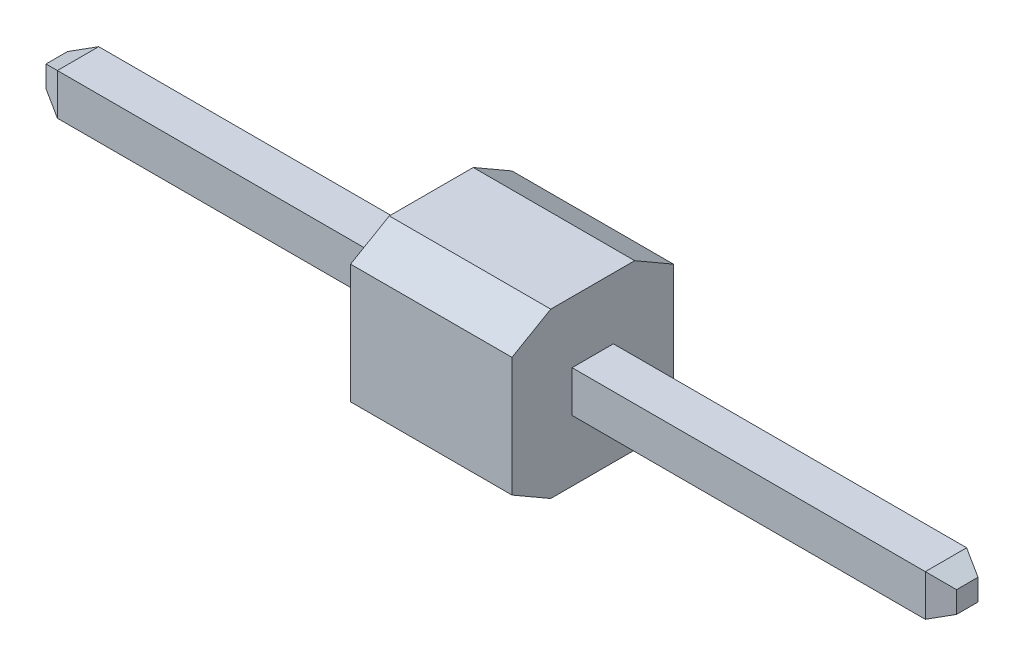
ISO-10303-21;
HEADER;
FILE_DESCRIPTION(('STEP AP214'),'2;1');
FILE_NAME('part.step','',(''),(''),'','','');
FILE_SCHEMA(('AUTOMOTIVE_DESIGN { 1 0 10303 214 1 1 1 1 }'));
ENDSEC;
DATA;
#1=APPLICATION_CONTEXT('core data for automotive mechanical design processes');
#2=APPLICATION_PROTOCOL_DEFINITION('international standard','automotive_design',2000,#1);
#3=PRODUCT_CONTEXT('',#1,'mechanical');
#4=PRODUCT('Part','Part','',(#3));
#5=PRODUCT_RELATED_PRODUCT_CATEGORY('part','',(#4));
#6=PRODUCT_DEFINITION_FORMATION('','',#4);
#7=PRODUCT_DEFINITION_CONTEXT('part definition',#1,'design');
#8=PRODUCT_DEFINITION('design','',#6,#7);
#9=PRODUCT_DEFINITION_SHAPE('','',#8);
#10=(LENGTH_UNIT() NAMED_UNIT(*) SI_UNIT(.MILLI.,.METRE.));
#11=(NAMED_UNIT(*) PLANE_ANGLE_UNIT() SI_UNIT($,.RADIAN.));
#12=(NAMED_UNIT(*) SI_UNIT($,.STERADIAN.) SOLID_ANGLE_UNIT());
#13=UNCERTAINTY_MEASURE_WITH_UNIT(LENGTH_MEASURE(1.E-05),#10,'distance_accuracy_value','');
#14=(GEOMETRIC_REPRESENTATION_CONTEXT(3) GLOBAL_UNCERTAINTY_ASSIGNED_CONTEXT((#13)) GLOBAL_UNIT_ASSIGNED_CONTEXT((#10,
#11,#12)) REPRESENTATION_CONTEXT('',''));
#15=CARTESIAN_POINT('',(0.,0.,0.));
#16=DIRECTION('',(0.,0.,1.));
#17=DIRECTION('',(1.,0.,0.));
#18=AXIS2_PLACEMENT_3D('',#15,#16,#17);
#19=CARTESIAN_POINT('',(5.42107439041138,12.3828717370861,0.629998634255617));
#20=DIRECTION('',(1.,4.37113882867379E-08,-4.37113882867379E-08));
#21=DIRECTION('',(-4.37113882867379E-08,1.,0.));
#22=AXIS2_PLACEMENT_3D('',#19,#20,#21);
#23=PLANE('',#22);
#24=DIRECTION('',(1.59994790123753E-08,0.50000000000019,0.866025403784329));
#25=VECTOR('',#24,1.);
#26=CARTESIAN_POINT('',(5.42107426742546,13.6264615755721,-0.940001365744382));
#27=LINE('',#26,#25);
#28=CARTESIAN_POINT('',(5.42107426742546,13.6264615755721,-0.940001365744382));
#29=VERTEX_POINT('',#28);
#30=CARTESIAN_POINT('',(5.42107427851022,13.9728717370861,-0.340001365744383));
#31=VERTEX_POINT('',#30);
#32=EDGE_CURVE('E11',#29,#31,#27,.T.);
#33=ORIENTED_EDGE('',*,*,#32,.T.);
#34=DIRECTION('',(4.37113886966664E-08,0.,0.999999999999999));
#35=VECTOR('',#34,1.);
#36=CARTESIAN_POINT('',(5.42107427851022,13.9728717370861,-0.340001365744383));
#37=LINE('',#36,#35);
#38=CARTESIAN_POINT('',(5.42107433533503,13.9728717370861,0.959998634255618));
#39=VERTEX_POINT('',#38);
#40=EDGE_CURVE('E304',#31,#39,#37,.T.);
#41=ORIENTED_EDGE('',*,*,#40,.T.);
#42=DIRECTION('',(5.97108656004285E-08,-0.500000000000188,0.866025403784328));
#43=VECTOR('',#42,1.);
#44=CARTESIAN_POINT('',(5.42107433533503,13.9728717370861,0.959998634255618));
#45=LINE('',#44,#43);
#46=CARTESIAN_POINT('',(5.42107437670393,13.6264615755721,1.55999863425562));
#47=VERTEX_POINT('',#46);
#48=EDGE_CURVE('E296',#39,#47,#45,.T.);
#49=ORIENTED_EDGE('',*,*,#48,.T.);
#50=DIRECTION('',(4.37113884815071E-08,-0.999999999999999,0.));
#51=VECTOR('',#50,1.);
#52=CARTESIAN_POINT('',(5.42107437670393,13.6264615755721,1.55999863425562));
#53=LINE('',#52,#51);
#54=CARTESIAN_POINT('',(5.42107445744672,11.7792818986001,1.55999863425562));
#55=VERTEX_POINT('',#54);
#56=EDGE_CURVE('E281',#47,#55,#53,.T.);
#57=ORIENTED_EDGE('',*,*,#56,.T.);
#58=DIRECTION('',(1.59994777304001E-08,0.50000000000019,0.866025403784329));
#59=VECTOR('',#58,1.);
#60=CARTESIAN_POINT('',(5.42107444636195,11.4328717370861,0.959998634255618));
#61=LINE('',#60,#59);
#62=CARTESIAN_POINT('',(5.42107444636195,11.4328717370861,0.959998634255618));
#63=VERTEX_POINT('',#62);
#64=EDGE_CURVE('E265',#63,#55,#61,.T.);
#65=ORIENTED_EDGE('',*,*,#64,.F.);
#66=DIRECTION('',(4.37113886966664E-08,0.,0.999999999999999));
#67=VECTOR('',#66,1.);
#68=CARTESIAN_POINT('',(5.42107438953715,11.4328717370861,-0.340001365744383));
#69=LINE('',#68,#67);
#70=CARTESIAN_POINT('',(5.42107438953715,11.4328717370861,-0.340001365744383));
#71=VERTEX_POINT('',#70);
#72=EDGE_CURVE('E248',#71,#63,#69,.T.);
#73=ORIENTED_EDGE('',*,*,#72,.F.);
#74=DIRECTION('',(5.97108668824036E-08,-0.500000000000188,0.866025403784328));
#75=VECTOR('',#74,1.);
#76=CARTESIAN_POINT('',(5.42107434816825,11.7792818986001,-0.940001365744382));
#77=LINE('',#76,#75);
#78=CARTESIAN_POINT('',(5.42107434816825,11.7792818986001,-0.940001365744382));
#79=VERTEX_POINT('',#78);
#80=EDGE_CURVE('E242',#79,#71,#77,.T.);
#81=ORIENTED_EDGE('',*,*,#80,.F.);
#82=DIRECTION('',(4.37113884815071E-08,-0.999999999999999,0.));
#83=VECTOR('',#82,1.);
#84=CARTESIAN_POINT('',(5.42107426742546,13.6264615755721,-0.940001365744382));
#85=LINE('',#84,#83);
#86=EDGE_CURVE('E236',#29,#79,#85,.T.);
#87=ORIENTED_EDGE('',*,*,#86,.F.);
#88=EDGE_LOOP('',(#33,#41,#49,#57,#65,#73,#81,#87));
#89=FACE_BOUND('',#88,.T.);
#90=DIRECTION('',(-4.37113900630947E-08,0.,-0.999999999999999));
#91=VECTOR('',#90,1.);
#92=CARTESIAN_POINT('',(5.42107436243609,13.0228717370861,0.629998634255617));
#93=LINE('',#92,#91);
#94=CARTESIAN_POINT('',(5.42107436243609,13.0228717370861,0.629998634255617));
#95=VERTEX_POINT('',#94);
#96=CARTESIAN_POINT('',(5.4210743344608,13.0228717370861,-0.0100013657443826));
#97=VERTEX_POINT('',#96);
#98=EDGE_CURVE('E302',#95,#97,#93,.T.);
#99=ORIENTED_EDGE('',*,*,#98,.T.);
#100=DIRECTION('',(-4.37113900630947E-08,0.999999999999999,0.));
#101=VECTOR('',#100,1.);
#102=CARTESIAN_POINT('',(5.42107436243609,12.3828717370861,-0.0100013657443826));
#103=LINE('',#102,#101);
#104=CARTESIAN_POINT('',(5.42107436243609,12.3828717370861,-0.0100013657443826));
#105=VERTEX_POINT('',#104);
#106=EDGE_CURVE('E293',#105,#97,#103,.T.);
#107=ORIENTED_EDGE('',*,*,#106,.F.);
#108=DIRECTION('',(-4.37113872875372E-08,0.,-0.999999999999999));
#109=VECTOR('',#108,1.);
#110=CARTESIAN_POINT('',(5.42107439041138,12.3828717370861,0.629998634255617));
#111=LINE('',#110,#109);
#112=CARTESIAN_POINT('',(5.42107439041138,12.3828717370861,0.629998634255617));
#113=VERTEX_POINT('',#112);
#114=EDGE_CURVE('E278',#113,#105,#111,.T.);
#115=ORIENTED_EDGE('',*,*,#114,.F.);
#116=DIRECTION('',(-4.37113872875371E-08,0.999999999999999,0.));
#117=VECTOR('',#116,1.);
#118=CARTESIAN_POINT('',(5.42107439041138,12.3828717370861,0.629998634255617));
#119=LINE('',#118,#117);
#120=EDGE_CURVE('E263',#113,#95,#119,.T.);
#121=ORIENTED_EDGE('',*,*,#120,.T.);
#122=EDGE_LOOP('',(#99,#107,#115,#121));
#123=FACE_BOUND('',#122,.T.);
#124=ADVANCED_FACE('F17',(#89,#123),#23,.T.);
#125=CARTESIAN_POINT('',(2.92107439041138,12.3828716278076,0.629998743534088));
#126=DIRECTION('',(1.,4.37113882867379E-08,-4.37113882867379E-08));
#127=DIRECTION('',(-4.37113882867379E-08,1.,0.));
#128=AXIS2_PLACEMENT_3D('',#125,#126,#127);
#129=PLANE('',#128);
#130=DIRECTION('',(1.59994783713877E-08,0.50000000000019,0.866025403784329));
#131=VECTOR('',#130,1.);
#132=CARTESIAN_POINT('',(2.92107426742546,13.6264614662936,-0.940001256465912));
#133=LINE('',#132,#131);
#134=CARTESIAN_POINT('',(2.92107426742546,13.6264614662936,-0.940001256465912));
#135=VERTEX_POINT('',#134);
#136=CARTESIAN_POINT('',(2.92107427851022,13.9728716278076,-0.340001256465912));
#137=VERTEX_POINT('',#136);
#138=EDGE_CURVE('E24',#135,#137,#133,.T.);
#139=ORIENTED_EDGE('',*,*,#138,.F.);
#140=DIRECTION('',(4.37113882410924E-08,-0.999999999999999,0.));
#141=VECTOR('',#140,1.);
#142=CARTESIAN_POINT('',(2.92107426742546,13.6264614662936,-0.940001256465912));
#143=LINE('',#142,#141);
#144=CARTESIAN_POINT('',(2.92107434816825,11.7792817893216,-0.940001256465912));
#145=VERTEX_POINT('',#144);
#146=EDGE_CURVE('E300',#135,#145,#143,.T.);
#147=ORIENTED_EDGE('',*,*,#146,.T.);
#148=DIRECTION('',(5.97108668824036E-08,-0.500000000000188,0.866025403784328));
#149=VECTOR('',#148,1.);
#150=CARTESIAN_POINT('',(2.92107434816825,11.7792817893216,-0.940001256465912));
#151=LINE('',#150,#149);
#152=CARTESIAN_POINT('',(2.92107438953715,11.4328716278076,-0.340001256465912));
#153=VERTEX_POINT('',#152);
#154=EDGE_CURVE('E286',#145,#153,#151,.T.);
#155=ORIENTED_EDGE('',*,*,#154,.T.);
#156=DIRECTION('',(4.37113883550593E-08,0.,0.999999999999999));
#157=VECTOR('',#156,1.);
#158=CARTESIAN_POINT('',(2.92107438953715,11.4328716278076,-0.340001256465912));
#159=LINE('',#158,#157);
#160=CARTESIAN_POINT('',(2.92107444636195,11.4328716278076,0.959998743534088));
#161=VERTEX_POINT('',#160);
#162=EDGE_CURVE('E271',#153,#161,#159,.T.);
#163=ORIENTED_EDGE('',*,*,#162,.T.);
#164=DIRECTION('',(1.59994783713877E-08,0.50000000000019,0.866025403784329));
#165=VECTOR('',#164,1.);
#166=CARTESIAN_POINT('',(2.92107444636195,11.4328716278076,0.959998743534088));
#167=LINE('',#166,#165);
#168=CARTESIAN_POINT('',(2.92107445744672,11.7792817893216,1.55999874353409));
#169=VERTEX_POINT('',#168);
#170=EDGE_CURVE('E253',#161,#169,#167,.T.);
#171=ORIENTED_EDGE('',*,*,#170,.T.);
#172=DIRECTION('',(4.37113882410924E-08,-0.999999999999999,0.));
#173=VECTOR('',#172,1.);
#174=CARTESIAN_POINT('',(2.92107437670393,13.6264614662936,1.55999874353409));
#175=LINE('',#174,#173);
#176=CARTESIAN_POINT('',(2.92107437670393,13.6264614662936,1.55999874353409));
#177=VERTEX_POINT('',#176);
#178=EDGE_CURVE('E261',#177,#169,#175,.T.);
#179=ORIENTED_EDGE('',*,*,#178,.F.);
#180=DIRECTION('',(5.97108668824036E-08,-0.500000000000188,0.866025403784328));
#181=VECTOR('',#180,1.);
#182=CARTESIAN_POINT('',(2.92107433533503,13.9728716278076,0.959998743534088));
#183=LINE('',#182,#181);
#184=CARTESIAN_POINT('',(2.92107433533503,13.9728716278076,0.959998743534088));
#185=VERTEX_POINT('',#184);
#186=EDGE_CURVE('E276',#185,#177,#183,.T.);
#187=ORIENTED_EDGE('',*,*,#186,.F.);
#188=DIRECTION('',(4.37113883550593E-08,0.,0.999999999999999));
#189=VECTOR('',#188,1.);
#190=CARTESIAN_POINT('',(2.92107427851022,13.9728716278076,-0.340001256465912));
#191=LINE('',#190,#189);
#192=EDGE_CURVE('E291',#137,#185,#191,.T.);
#193=ORIENTED_EDGE('',*,*,#192,.F.);
#194=EDGE_LOOP('',(#139,#147,#155,#163,#171,#179,#187,#193));
#195=FACE_BOUND('',#194,.T.);
#196=DIRECTION('',(-4.37113886753159E-08,0.999999999999999,0.));
#197=VECTOR('',#196,1.);
#198=CARTESIAN_POINT('',(2.92107436243609,12.3828716278076,-0.0100012564659119));
#199=LINE('',#198,#197);
#200=CARTESIAN_POINT('',(2.92107436243609,12.3828716278076,-0.0100012564659119));
#201=VERTEX_POINT('',#200);
#202=CARTESIAN_POINT('',(2.9210743344608,13.0228716278076,-0.0100012564659119));
#203=VERTEX_POINT('',#202);
#204=EDGE_CURVE('E298',#201,#203,#199,.T.);
#205=ORIENTED_EDGE('',*,*,#204,.T.);
#206=DIRECTION('',(-4.37113886753159E-08,0.,-0.999999999999999));
#207=VECTOR('',#206,1.);
#208=CARTESIAN_POINT('',(2.92107436243609,13.0228716278076,0.629998743534088));
#209=LINE('',#208,#207);
#210=CARTESIAN_POINT('',(2.92107436243609,13.0228716278076,0.629998743534088));
#211=VERTEX_POINT('',#210);
#212=EDGE_CURVE('E283',#211,#203,#209,.T.);
#213=ORIENTED_EDGE('',*,*,#212,.F.);
#214=DIRECTION('',(-4.37113879814265E-08,0.999999999999999,0.));
#215=VECTOR('',#214,1.);
#216=CARTESIAN_POINT('',(2.92107439041138,12.3828716278076,0.629998743534088));
#217=LINE('',#216,#215);
#218=CARTESIAN_POINT('',(2.92107439041138,12.3828716278076,0.629998743534088));
#219=VERTEX_POINT('',#218);
#220=EDGE_CURVE('E268',#219,#211,#217,.T.);
#221=ORIENTED_EDGE('',*,*,#220,.F.);
#222=DIRECTION('',(-4.37113879814266E-08,0.,-0.999999999999999));
#223=VECTOR('',#222,1.);
#224=CARTESIAN_POINT('',(2.92107439041138,12.3828716278076,0.629998743534088));
#225=LINE('',#224,#223);
#226=EDGE_CURVE('E251',#219,#201,#225,.T.);
#227=ORIENTED_EDGE('',*,*,#226,.T.);
#228=EDGE_LOOP('',(#205,#213,#221,#227));
#229=FACE_BOUND('',#228,.T.);
#230=ADVANCED_FACE('F314',(#195,#229),#129,.F.);
#231=CARTESIAN_POINT('',(5.42107426742546,13.6264615755721,-0.940001365744382));
#232=DIRECTION('',(5.97108668343731E-08,-0.866025403784328,0.50000000000019));
#233=DIRECTION('',(-1.59994785476185E-08,-0.500000000000192,-0.866025403784329));
#234=AXIS2_PLACEMENT_3D('',#231,#232,#233);
#235=PLANE('',#234);
#236=ORIENTED_EDGE('',*,*,#138,.T.);
#237=DIRECTION('',(-0.999999999999998,-4.37113882867378E-08,4.37113883755557E-08));
#238=VECTOR('',#237,1.);
#239=CARTESIAN_POINT('',(5.42107427851022,13.9728717370861,-0.340001365744383));
#240=LINE('',#239,#238);
#241=EDGE_CURVE('E288',#31,#137,#240,.T.);
#242=ORIENTED_EDGE('',*,*,#241,.F.);
#243=ORIENTED_EDGE('',*,*,#32,.F.);
#244=DIRECTION('',(-0.999999999999998,-4.37113882867378E-08,4.37113881091022E-08));
#245=VECTOR('',#244,1.);
#246=CARTESIAN_POINT('',(5.42107426742546,13.6264615755721,-0.940001365744382));
#247=LINE('',#246,#245);
#248=EDGE_CURVE('E256',#29,#135,#247,.T.);
#249=ORIENTED_EDGE('',*,*,#248,.T.);
#250=EDGE_LOOP('',(#236,#242,#243,#249));
#251=FACE_BOUND('',#250,.T.);
#252=ADVANCED_FACE('F306',(#251),#235,.F.);
#253=CARTESIAN_POINT('',(5.42107427851022,13.9728717370861,-0.340001365744383));
#254=DIRECTION('',(4.37113882867379E-08,-1.,0.));
#255=DIRECTION('',(1.,4.37113882867379E-08,-4.37113882867379E-08));
#256=AXIS2_PLACEMENT_3D('',#253,#254,#255);
#257=PLANE('',#256);
#258=ORIENTED_EDGE('',*,*,#192,.T.);
#259=DIRECTION('',(-0.999999999999998,-4.37113882867378E-08,4.37113882867378E-08));
#260=VECTOR('',#259,1.);
#261=CARTESIAN_POINT('',(5.42107433533503,13.9728717370861,0.959998634255618));
#262=LINE('',#261,#260);
#263=EDGE_CURVE('E273',#39,#185,#262,.T.);
#264=ORIENTED_EDGE('',*,*,#263,.F.);
#265=ORIENTED_EDGE('',*,*,#40,.F.);
#266=ORIENTED_EDGE('',*,*,#241,.T.);
#267=EDGE_LOOP('',(#258,#264,#265,#266));
#268=FACE_BOUND('',#267,.T.);
#269=ADVANCED_FACE('F311',(#268),#257,.F.);
#270=CARTESIAN_POINT('',(5.42107433533503,13.9728717370861,0.959998634255618));
#271=DIRECTION('',(1.59994785476185E-08,-0.86602540378433,-0.50000000000019));
#272=DIRECTION('',(-5.97108668343731E-08,0.500000000000188,-0.866025403784329));
#273=AXIS2_PLACEMENT_3D('',#270,#271,#272);
#274=PLANE('',#273);
#275=ORIENTED_EDGE('',*,*,#186,.T.);
#276=DIRECTION('',(-0.999999999999998,-4.37113882867378E-08,4.37113882867378E-08));
#277=VECTOR('',#276,1.);
#278=CARTESIAN_POINT('',(5.42107437670393,13.6264615755721,1.55999863425562));
#279=LINE('',#278,#277);
#280=EDGE_CURVE('E258',#47,#177,#279,.T.);
#281=ORIENTED_EDGE('',*,*,#280,.F.);
#282=ORIENTED_EDGE('',*,*,#48,.F.);
#283=ORIENTED_EDGE('',*,*,#263,.T.);
#284=EDGE_LOOP('',(#275,#281,#282,#283));
#285=FACE_BOUND('',#284,.T.);
#286=ADVANCED_FACE('F319',(#285),#274,.F.);
#287=CARTESIAN_POINT('',(5.42107437670393,13.6264615755721,1.55999863425562));
#288=DIRECTION('',(-4.37113882867379E-08,0.,-1.));
#289=DIRECTION('',(-1.,-4.37113882867379E-08,4.37113882867379E-08));
#290=AXIS2_PLACEMENT_3D('',#287,#288,#289);
#291=PLANE('',#290);
#292=ORIENTED_EDGE('',*,*,#178,.T.);
#293=DIRECTION('',(-0.999999999999998,-4.37113882867378E-08,4.37113882867378E-08));
#294=VECTOR('',#293,1.);
#295=CARTESIAN_POINT('',(5.42107445744672,11.7792818986001,1.55999863425562));
#296=LINE('',#295,#294);
#297=EDGE_CURVE('E245',#55,#169,#296,.T.);
#298=ORIENTED_EDGE('',*,*,#297,.F.);
#299=ORIENTED_EDGE('',*,*,#56,.F.);
#300=ORIENTED_EDGE('',*,*,#280,.T.);
#301=EDGE_LOOP('',(#292,#298,#299,#300));
#302=FACE_BOUND('',#301,.T.);
#303=ADVANCED_FACE('F326',(#302),#291,.F.);
#304=CARTESIAN_POINT('',(5.42107444636195,11.4328717370861,0.959998634255618));
#305=DIRECTION('',(5.97108668343731E-08,-0.866025403784328,0.50000000000019));
#306=DIRECTION('',(-1.59994785476185E-08,-0.500000000000192,-0.866025403784329));
#307=AXIS2_PLACEMENT_3D('',#304,#305,#306);
#308=PLANE('',#307);
#309=ORIENTED_EDGE('',*,*,#170,.F.);
#310=DIRECTION('',(-0.999999999999998,-4.37113882867378E-08,4.37113882867378E-08));
#311=VECTOR('',#310,1.);
#312=CARTESIAN_POINT('',(5.42107444636195,11.4328717370861,0.959998634255618));
#313=LINE('',#312,#311);
#314=EDGE_CURVE('E239',#63,#161,#313,.T.);
#315=ORIENTED_EDGE('',*,*,#314,.F.);
#316=ORIENTED_EDGE('',*,*,#64,.T.);
#317=ORIENTED_EDGE('',*,*,#297,.T.);
#318=EDGE_LOOP('',(#309,#315,#316,#317));
#319=FACE_BOUND('',#318,.T.);
#320=ADVANCED_FACE('F329',(#319),#308,.T.);
#321=CARTESIAN_POINT('',(5.42107438953715,11.4328717370861,-0.340001365744383));
#322=DIRECTION('',(4.37113882867379E-08,-1.,0.));
#323=DIRECTION('',(1.,4.37113882867379E-08,-4.37113882867379E-08));
#324=AXIS2_PLACEMENT_3D('',#321,#322,#323);
#325=PLANE('',#324);
#326=ORIENTED_EDGE('',*,*,#162,.F.);
#327=DIRECTION('',(-0.999999999999998,-4.37113889972806E-08,4.37113883755557E-08));
#328=VECTOR('',#327,1.);
#329=CARTESIAN_POINT('',(5.42107438953715,11.4328717370861,-0.340001365744383));
#330=LINE('',#329,#328);
#331=EDGE_CURVE('E233',#71,#153,#330,.T.);
#332=ORIENTED_EDGE('',*,*,#331,.F.);
#333=ORIENTED_EDGE('',*,*,#72,.T.);
#334=ORIENTED_EDGE('',*,*,#314,.T.);
#335=EDGE_LOOP('',(#326,#332,#333,#334));
#336=FACE_BOUND('',#335,.T.);
#337=ADVANCED_FACE('F333',(#336),#325,.T.);
#338=CARTESIAN_POINT('',(5.42107434816825,11.7792818986001,-0.940001365744382));
#339=DIRECTION('',(1.59994785476185E-08,-0.86602540378433,-0.50000000000019));
#340=DIRECTION('',(-5.97108668343731E-08,0.500000000000188,-0.866025403784329));
#341=AXIS2_PLACEMENT_3D('',#338,#339,#340);
#342=PLANE('',#341);
#343=ORIENTED_EDGE('',*,*,#154,.F.);
#344=DIRECTION('',(-0.999999999999998,-4.37113882867378E-08,4.37113881091022E-08));
#345=VECTOR('',#344,1.);
#346=CARTESIAN_POINT('',(5.42107434816825,11.7792818986001,-0.940001365744382));
#347=LINE('',#346,#345);
#348=EDGE_CURVE('E230',#79,#145,#347,.T.);
#349=ORIENTED_EDGE('',*,*,#348,.F.);
#350=ORIENTED_EDGE('',*,*,#80,.T.);
#351=ORIENTED_EDGE('',*,*,#331,.T.);
#352=EDGE_LOOP('',(#343,#349,#350,#351));
#353=FACE_BOUND('',#352,.T.);
#354=ADVANCED_FACE('F337',(#353),#342,.T.);
#355=CARTESIAN_POINT('',(5.42107426742546,13.6264615755721,-0.940001365744382));
#356=DIRECTION('',(-4.37113882867379E-08,0.,-1.));
#357=DIRECTION('',(-4.37113882867379E-08,1.,0.));
#358=AXIS2_PLACEMENT_3D('',#355,#356,#357);
#359=PLANE('',#358);
#360=ORIENTED_EDGE('',*,*,#146,.F.);
#361=ORIENTED_EDGE('',*,*,#248,.F.);
#362=ORIENTED_EDGE('',*,*,#86,.T.);
#363=ORIENTED_EDGE('',*,*,#348,.T.);
#364=EDGE_LOOP('',(#360,#361,#362,#363));
#365=FACE_BOUND('',#364,.T.);
#366=ADVANCED_FACE('F339',(#365),#359,.T.);
#367=CARTESIAN_POINT('',(-2.87892560958862,12.3828713742816,0.62999899706014));
#368=DIRECTION('',(-1.,-4.37113882867379E-08,4.37113882867379E-08));
#369=DIRECTION('',(4.37113882867379E-08,-1.,0.));
#370=AXIS2_PLACEMENT_3D('',#367,#368,#369);
#371=PLANE('',#370);
#372=DIRECTION('',(4.37113927480282E-08,-0.999999999999999,0.));
#373=VECTOR('',#372,1.);
#374=CARTESIAN_POINT('',(-2.87892565208645,12.8689898470906,0.14388052425114));
#375=LINE('',#374,#373);
#376=CARTESIAN_POINT('',(-2.87892565208645,12.8689898470906,0.14388052425114));
#377=VERTEX_POINT('',#376);
#378=CARTESIAN_POINT('',(-2.87892563756391,12.5367529014726,0.14388052425114));
#379=VERTEX_POINT('',#378);
#380=EDGE_CURVE('E228',#377,#379,#375,.T.);
#381=ORIENTED_EDGE('',*,*,#380,.T.);
#382=DIRECTION('',(4.37113900746999E-08,0.,0.999999999999999));
#383=VECTOR('',#382,1.);
#384=CARTESIAN_POINT('',(-2.87892563756391,12.5367529014726,0.14388052425114));
#385=LINE('',#384,#383);
#386=CARTESIAN_POINT('',(-2.87892562304137,12.5367529014726,0.47611746986914));
#387=VERTEX_POINT('',#386);
#388=EDGE_CURVE('E223',#379,#387,#385,.T.);
#389=ORIENTED_EDGE('',*,*,#388,.T.);
#390=DIRECTION('',(-4.37113847280434E-08,0.999999999999999,0.));
#391=VECTOR('',#390,1.);
#392=CARTESIAN_POINT('',(-2.87892562304137,12.5367529014726,0.47611746986914));
#393=LINE('',#392,#391);
#394=CARTESIAN_POINT('',(-2.87892563756391,12.8689898470906,0.47611746986914));
#395=VERTEX_POINT('',#394);
#396=EDGE_CURVE('E215',#387,#395,#393,.T.);
#397=ORIENTED_EDGE('',*,*,#396,.T.);
#398=DIRECTION('',(-4.37113820547151E-08,0.,-0.999999999999999));
#399=VECTOR('',#398,1.);
#400=CARTESIAN_POINT('',(-2.87892563756391,12.8689898470906,0.47611746986914));
#401=LINE('',#400,#399);
#402=EDGE_CURVE('E207',#395,#377,#401,.T.);
#403=ORIENTED_EDGE('',*,*,#402,.T.);
#404=EDGE_LOOP('',(#381,#389,#397,#403));
#405=FACE_BOUND('',#404,.T.);
#406=ADVANCED_FACE('F341',(#405),#371,.T.);
#407=CARTESIAN_POINT('',(-2.87892560958862,12.3828713742816,0.62999899706014));
#408=DIRECTION('',(4.37113882867379E-08,-1.,0.));
#409=DIRECTION('',(-4.37113882867379E-08,0.,-1.));
#410=AXIS2_PLACEMENT_3D('',#407,#408,#409);
#411=PLANE('',#410);
#412=DIRECTION('',(0.999999999999998,4.37113881958092E-08,-4.37113882769955E-08));
#413=VECTOR('',#412,1.);
#414=CARTESIAN_POINT('',(-2.54892560958862,12.3828713887063,0.629998982635382));
#415=LINE('',#414,#413);
#416=CARTESIAN_POINT('',(-2.54892560958862,12.3828713887063,0.629998982635382));
#417=VERTEX_POINT('',#416);
#418=EDGE_CURVE('E225',#417,#219,#415,.T.);
#419=ORIENTED_EDGE('',*,*,#418,.F.);
#420=DIRECTION('',(-4.37113886753159E-08,0.,-0.999999999999999));
#421=VECTOR('',#420,1.);
#422=CARTESIAN_POINT('',(-2.54892560958862,12.3828713887063,0.629998982635382));
#423=LINE('',#422,#421);
#424=CARTESIAN_POINT('',(-2.54892563756391,12.3828713887063,-0.010001017364618));
#425=VERTEX_POINT('',#424);
#426=EDGE_CURVE('E217',#417,#425,#423,.T.);
#427=ORIENTED_EDGE('',*,*,#426,.T.);
#428=DIRECTION('',(0.999999999999998,4.37113881958092E-08,-4.37113882161057E-08));
#429=VECTOR('',#428,1.);
#430=CARTESIAN_POINT('',(-2.54892563756391,12.3828713887063,-0.010001017364618));
#431=LINE('',#430,#429);
#432=EDGE_CURVE('E220',#425,#201,#431,.T.);
#433=ORIENTED_EDGE('',*,*,#432,.T.);
#434=ORIENTED_EDGE('',*,*,#226,.F.);
#435=EDGE_LOOP('',(#419,#427,#433,#434));
#436=FACE_BOUND('',#435,.T.);
#437=ADVANCED_FACE('F348',(#436),#411,.T.);
#438=CARTESIAN_POINT('',(-2.87892563756391,12.3828713742816,-0.0100010029398598));
#439=DIRECTION('',(-4.37113882867379E-08,0.,-1.));
#440=DIRECTION('',(-1.,-4.37113882867379E-08,4.37113882867379E-08));
#441=AXIS2_PLACEMENT_3D('',#438,#439,#440);
#442=PLANE('',#441);
#443=ORIENTED_EDGE('',*,*,#432,.F.);
#444=DIRECTION('',(-4.37113872875371E-08,0.999999999999999,0.));
#445=VECTOR('',#444,1.);
#446=CARTESIAN_POINT('',(-2.54892563756391,12.3828713887063,-0.010001017364618));
#447=LINE('',#446,#445);
#448=CARTESIAN_POINT('',(-2.5489256655392,13.0228713887063,-0.010001017364618));
#449=VERTEX_POINT('',#448);
#450=EDGE_CURVE('E209',#425,#449,#447,.T.);
#451=ORIENTED_EDGE('',*,*,#450,.T.);
#452=DIRECTION('',(0.999999999999998,4.37113881958092E-08,-4.37113882161058E-08));
#453=VECTOR('',#452,1.);
#454=CARTESIAN_POINT('',(-2.5489256655392,13.0228713887063,-0.010001017364618));
#455=LINE('',#454,#453);
#456=EDGE_CURVE('E212',#449,#203,#455,.T.);
#457=ORIENTED_EDGE('',*,*,#456,.T.);
#458=ORIENTED_EDGE('',*,*,#204,.F.);
#459=EDGE_LOOP('',(#443,#451,#457,#458));
#460=FACE_BOUND('',#459,.T.);
#461=ADVANCED_FACE('F424',(#460),#442,.T.);
#462=CARTESIAN_POINT('',(-2.87892563756391,13.0228713742816,0.62999899706014));
#463=DIRECTION('',(4.37113882867379E-08,-1.,0.));
#464=DIRECTION('',(-4.37113882867379E-08,0.,-1.));
#465=AXIS2_PLACEMENT_3D('',#462,#463,#464);
#466=PLANE('',#465);
#467=ORIENTED_EDGE('',*,*,#456,.F.);
#468=DIRECTION('',(4.37113886753159E-08,0.,0.999999999999999));
#469=VECTOR('',#468,1.);
#470=CARTESIAN_POINT('',(-2.5489256655392,13.0228713887063,-0.010001017364618));
#471=LINE('',#470,#469);
#472=CARTESIAN_POINT('',(-2.54892563756391,13.0228713887063,0.629998982635382));
#473=VERTEX_POINT('',#472);
#474=EDGE_CURVE('E201',#449,#473,#471,.T.);
#475=ORIENTED_EDGE('',*,*,#474,.T.);
#476=DIRECTION('',(0.999999999999998,4.37113885205545E-08,-4.37113882769955E-08));
#477=VECTOR('',#476,1.);
#478=CARTESIAN_POINT('',(-2.54892563756391,13.0228713887063,0.629998982635382));
#479=LINE('',#478,#477);
#480=EDGE_CURVE('E204',#473,#211,#479,.T.);
#481=ORIENTED_EDGE('',*,*,#480,.T.);
#482=ORIENTED_EDGE('',*,*,#212,.T.);
#483=EDGE_LOOP('',(#467,#475,#481,#482));
#484=FACE_BOUND('',#483,.T.);
#485=ADVANCED_FACE('F421',(#484),#466,.F.);
#486=CARTESIAN_POINT('',(-2.87892560958862,12.3828713742816,0.62999899706014));
#487=DIRECTION('',(-4.37113882867379E-08,0.,-1.));
#488=DIRECTION('',(-1.,-4.37113882867379E-08,4.37113882867379E-08));
#489=AXIS2_PLACEMENT_3D('',#486,#487,#488);
#490=PLANE('',#489);
#491=ORIENTED_EDGE('',*,*,#480,.F.);
#492=DIRECTION('',(4.37113900630948E-08,-0.999999999999999,0.));
#493=VECTOR('',#492,1.);
#494=CARTESIAN_POINT('',(-2.54892563756391,13.0228713887063,0.629998982635382));
#495=LINE('',#494,#493);
#496=EDGE_CURVE('E196',#473,#417,#495,.T.);
#497=ORIENTED_EDGE('',*,*,#496,.T.);
#498=ORIENTED_EDGE('',*,*,#418,.T.);
#499=ORIENTED_EDGE('',*,*,#220,.T.);
#500=EDGE_LOOP('',(#491,#497,#498,#499));
#501=FACE_BOUND('',#500,.T.);
#502=ADVANCED_FACE('F376',(#501),#490,.F.);
#503=CARTESIAN_POINT('',(-2.87892560958862,12.3828713742816,0.62999899706014));
#504=DIRECTION('',(-4.37113882867379E-08,0.,-1.));
#505=DIRECTION('',(-1.,-4.37113882867379E-08,4.37113882867379E-08));
#506=AXIS2_PLACEMENT_3D('',#503,#504,#505);
#507=PLANE('',#506);
#508=DIRECTION('',(0.999999999999998,4.37113881958092E-08,-4.37113882769955E-08));
#509=VECTOR('',#508,1.);
#510=CARTESIAN_POINT('',(5.42107439041138,12.3828717370861,0.629998634255617));
#511=LINE('',#510,#509);
#512=CARTESIAN_POINT('',(10.8910743904114,12.3828719761874,0.629998395154324));
#513=VERTEX_POINT('',#512);
#514=EDGE_CURVE('E199',#113,#513,#511,.T.);
#515=ORIENTED_EDGE('',*,*,#514,.T.);
#516=DIRECTION('',(-4.37113900630947E-08,0.999999999999999,0.));
#517=VECTOR('',#516,1.);
#518=CARTESIAN_POINT('',(10.8910743904114,12.3828719761874,0.629998395154324));
#519=LINE('',#518,#517);
#520=CARTESIAN_POINT('',(10.8910743624361,13.0228719761874,0.629998395154324));
#521=VERTEX_POINT('',#520);
#522=EDGE_CURVE('E191',#513,#521,#519,.T.);
#523=ORIENTED_EDGE('',*,*,#522,.T.);
#524=DIRECTION('',(0.999999999999998,4.37113878710639E-08,-4.37113882769955E-08));
#525=VECTOR('',#524,1.);
#526=CARTESIAN_POINT('',(5.42107436243609,13.0228717370861,0.629998634255617));
#527=LINE('',#526,#525);
#528=EDGE_CURVE('E194',#95,#521,#527,.T.);
#529=ORIENTED_EDGE('',*,*,#528,.F.);
#530=ORIENTED_EDGE('',*,*,#120,.F.);
#531=EDGE_LOOP('',(#515,#523,#529,#530));
#532=FACE_BOUND('',#531,.T.);
#533=ADVANCED_FACE('F367',(#532),#507,.F.);
#534=CARTESIAN_POINT('',(-2.87892563756391,13.0228713742816,0.62999899706014));
#535=DIRECTION('',(4.37113882867379E-08,-1.,0.));
#536=DIRECTION('',(-4.37113882867379E-08,0.,-1.));
#537=AXIS2_PLACEMENT_3D('',#534,#535,#536);
#538=PLANE('',#537);
#539=ORIENTED_EDGE('',*,*,#528,.T.);
#540=DIRECTION('',(-4.37113872875372E-08,0.,-0.999999999999999));
#541=VECTOR('',#540,1.);
#542=CARTESIAN_POINT('',(10.8910743624361,13.0228719761874,0.629998395154324));
#543=LINE('',#542,#541);
#544=CARTESIAN_POINT('',(10.8910743344608,13.0228719761874,-0.0100016048456765));
#545=VERTEX_POINT('',#544);
#546=EDGE_CURVE('E186',#521,#545,#543,.T.);
#547=ORIENTED_EDGE('',*,*,#546,.T.);
#548=DIRECTION('',(0.999999999999998,4.37113881958092E-08,-4.37113881146228E-08));
#549=VECTOR('',#548,1.);
#550=CARTESIAN_POINT('',(5.4210743344608,13.0228717370861,-0.0100013657443823));
#551=LINE('',#550,#549);
#552=EDGE_CURVE('E189',#97,#545,#551,.T.);
#553=ORIENTED_EDGE('',*,*,#552,.F.);
#554=ORIENTED_EDGE('',*,*,#98,.F.);
#555=EDGE_LOOP('',(#539,#547,#553,#554));
#556=FACE_BOUND('',#555,.T.);
#557=ADVANCED_FACE('F364',(#556),#538,.F.);
#558=CARTESIAN_POINT('',(-2.87892563756391,12.3828713742816,-0.0100010029398598));
#559=DIRECTION('',(-4.37113882867379E-08,0.,-1.));
#560=DIRECTION('',(-1.,-4.37113882867379E-08,4.37113882867379E-08));
#561=AXIS2_PLACEMENT_3D('',#558,#559,#560);
#562=PLANE('',#561);
#563=ORIENTED_EDGE('',*,*,#552,.T.);
#564=DIRECTION('',(4.37113872875372E-08,-0.999999999999999,0.));
#565=VECTOR('',#564,1.);
#566=CARTESIAN_POINT('',(10.8910743344608,13.0228719761874,-0.0100016048456764));
#567=LINE('',#566,#565);
#568=CARTESIAN_POINT('',(10.8910743624361,12.3828719761874,-0.0100016048456765));
#569=VERTEX_POINT('',#568);
#570=EDGE_CURVE('E176',#545,#569,#567,.T.);
#571=ORIENTED_EDGE('',*,*,#570,.T.);
#572=DIRECTION('',(0.999999999999998,4.37113885205545E-08,-4.37113881146229E-08));
#573=VECTOR('',#572,1.);
#574=CARTESIAN_POINT('',(5.42107436243609,12.3828717370861,-0.0100013657443823));
#575=LINE('',#574,#573);
#576=EDGE_CURVE('E179',#105,#569,#575,.T.);
#577=ORIENTED_EDGE('',*,*,#576,.F.);
#578=ORIENTED_EDGE('',*,*,#106,.T.);
#579=EDGE_LOOP('',(#563,#571,#577,#578));
#580=FACE_BOUND('',#579,.T.);
#581=ADVANCED_FACE('F366',(#580),#562,.T.);
#582=CARTESIAN_POINT('',(-2.87892560958862,12.3828713742816,0.62999899706014));
#583=DIRECTION('',(4.37113882867379E-08,-1.,0.));
#584=DIRECTION('',(-4.37113882867379E-08,0.,-1.));
#585=AXIS2_PLACEMENT_3D('',#582,#583,#584);
#586=PLANE('',#585);
#587=ORIENTED_EDGE('',*,*,#576,.T.);
#588=DIRECTION('',(4.37113845119796E-08,0.,0.999999999999999));
#589=VECTOR('',#588,1.);
#590=CARTESIAN_POINT('',(10.8910743624361,12.3828719761874,-0.0100016048456765));
#591=LINE('',#590,#589);
#592=EDGE_CURVE('E167',#569,#513,#591,.T.);
#593=ORIENTED_EDGE('',*,*,#592,.T.);
#594=ORIENTED_EDGE('',*,*,#514,.F.);
#595=ORIENTED_EDGE('',*,*,#114,.T.);
#596=EDGE_LOOP('',(#587,#593,#594,#595));
#597=FACE_BOUND('',#596,.T.);
#598=ADVANCED_FACE('F373',(#597),#586,.T.);
#599=CARTESIAN_POINT('',(11.2210743904114,12.3828719906121,0.629998380729565));
#600=DIRECTION('',(-1.,-4.37113882867379E-08,4.37113882867379E-08));
#601=DIRECTION('',(4.37113882867379E-08,-1.,0.));
#602=AXIS2_PLACEMENT_3D('',#599,#600,#601);
#603=PLANE('',#602);
#604=DIRECTION('',(-4.37113980946847E-08,0.999999999999999,0.));
#605=VECTOR('',#604,1.);
#606=CARTESIAN_POINT('',(11.2210743624361,12.5367535178031,0.143879907920565));
#607=LINE('',#606,#605);
#608=CARTESIAN_POINT('',(11.2210743624361,12.5367535178031,0.143879907920565));
#609=VERTEX_POINT('',#608);
#610=CARTESIAN_POINT('',(11.2210743479135,12.8689904634211,0.143879907920565));
#611=VERTEX_POINT('',#610);
#612=EDGE_CURVE('E153',#609,#611,#607,.T.);
#613=ORIENTED_EDGE('',*,*,#612,.T.);
#614=DIRECTION('',(4.37113927480282E-08,0.,0.999999999999999));
#615=VECTOR('',#614,1.);
#616=CARTESIAN_POINT('',(11.2210743479135,12.8689904634211,0.143879907920565));
#617=LINE('',#616,#615);
#618=CARTESIAN_POINT('',(11.2210743624361,12.8689904634211,0.476116853538565));
#619=VERTEX_POINT('',#618);
#620=EDGE_CURVE('E395',#611,#619,#617,.T.);
#621=ORIENTED_EDGE('',*,*,#620,.T.);
#622=DIRECTION('',(4.37113820547151E-08,-0.999999999999999,0.));
#623=VECTOR('',#622,1.);
#624=CARTESIAN_POINT('',(11.2210743624361,12.8689904634211,0.476116853538565));
#625=LINE('',#624,#623);
#626=CARTESIAN_POINT('',(11.2210743769586,12.5367535178031,0.476116853538565));
#627=VERTEX_POINT('',#626);
#628=EDGE_CURVE('E156',#619,#627,#625,.T.);
#629=ORIENTED_EDGE('',*,*,#628,.T.);
#630=DIRECTION('',(-4.37113927480282E-08,0.,-0.999999999999999));
#631=VECTOR('',#630,1.);
#632=CARTESIAN_POINT('',(11.2210743769586,12.5367535178031,0.476116853538565));
#633=LINE('',#632,#631);
#634=EDGE_CURVE('E149',#627,#609,#633,.T.);
#635=ORIENTED_EDGE('',*,*,#634,.T.);
#636=EDGE_LOOP('',(#613,#621,#629,#635));
#637=FACE_BOUND('',#636,.T.);
#638=ADVANCED_FACE('F151',(#637),#603,.F.);
#639=CARTESIAN_POINT('',(-2.87892563083754,12.8689898470906,0.62999899706014));
#640=DIRECTION('',(-0.422618301356784,0.906307768563367,1.84732310895534E-08));
#641=DIRECTION('',(4.37113882867379E-08,0.,1.));
#642=AXIS2_PLACEMENT_3D('',#639,#640,#641);
#643=PLANE('',#642);
#644=DIRECTION('',(0.834817095446927,0.389281657126016,-0.389281657126019));
#645=VECTOR('',#644,1.);
#646=CARTESIAN_POINT('',(-2.87892565208614,12.8689898470902,0.143880524251471));
#647=LINE('',#646,#645);
#648=EDGE_CURVE('E181',#377,#449,#647,.T.);
#649=ORIENTED_EDGE('',*,*,#648,.F.);
#650=ORIENTED_EDGE('',*,*,#402,.F.);
#651=DIRECTION('',(-0.834817129479006,-0.38928165712602,-0.389281584143987));
#652=VECTOR('',#651,1.);
#653=CARTESIAN_POINT('',(-2.54892563756369,13.0228713887061,0.629998982635147));
#654=LINE('',#653,#652);
#655=EDGE_CURVE('E404',#473,#395,#654,.T.);
#656=ORIENTED_EDGE('',*,*,#655,.F.);
#657=ORIENTED_EDGE('',*,*,#474,.F.);
#658=EDGE_LOOP('',(#649,#650,#656,#657));
#659=FACE_BOUND('',#658,.T.);
#660=ADVANCED_FACE('F418',(#659),#643,.T.);
#661=CARTESIAN_POINT('',(-2.878925616315,12.3828713742816,0.47611746986914));
#662=DIRECTION('',(-0.422618222124841,-1.84732292043498E-08,0.906307805509828));
#663=DIRECTION('',(4.37113882867379E-08,-1.,0.));
#664=AXIS2_PLACEMENT_3D('',#661,#662,#663);
#665=PLANE('',#664);
#666=ORIENTED_EDGE('',*,*,#655,.T.);
#667=ORIENTED_EDGE('',*,*,#396,.F.);
#668=DIRECTION('',(-0.834817163511086,0.389281584143985,-0.389281584143989));
#669=VECTOR('',#668,1.);
#670=CARTESIAN_POINT('',(-2.54892560958845,12.3828713887065,0.629998982635199));
#671=LINE('',#670,#669);
#672=EDGE_CURVE('E160',#417,#387,#671,.T.);
#673=ORIENTED_EDGE('',*,*,#672,.F.);
#674=ORIENTED_EDGE('',*,*,#496,.F.);
#675=EDGE_LOOP('',(#666,#667,#673,#674));
#676=FACE_BOUND('',#675,.T.);
#677=ADVANCED_FACE('F434',(#676),#665,.T.);
#678=CARTESIAN_POINT('',(-2.54892563756391,12.3828713887063,-0.010001017364618));
#679=DIRECTION('',(0.422618301356784,1.8473232667688E-08,0.906307768563367));
#680=DIRECTION('',(-4.37113882867379E-08,1.,0.));
#681=AXIS2_PLACEMENT_3D('',#678,#679,#680);
#682=PLANE('',#681);
#683=ORIENTED_EDGE('',*,*,#648,.T.);
#684=ORIENTED_EDGE('',*,*,#450,.F.);
#685=DIRECTION('',(0.834817129479007,-0.389281584143988,-0.389281657126018));
#686=VECTOR('',#685,1.);
#687=CARTESIAN_POINT('',(-2.87892563756382,12.5367529014727,0.143880524251236));
#688=LINE('',#687,#686);
#689=EDGE_CURVE('E170',#379,#425,#688,.T.);
#690=ORIENTED_EDGE('',*,*,#689,.F.);
#691=ORIENTED_EDGE('',*,*,#380,.F.);
#692=EDGE_LOOP('',(#683,#684,#690,#691));
#693=FACE_BOUND('',#692,.T.);
#694=ADVANCED_FACE('F413',(#693),#682,.F.);
#695=CARTESIAN_POINT('',(-2.54892560958862,12.3828713887063,0.629998982635382));
#696=DIRECTION('',(0.422618222124841,0.906307805509828,-1.84732308250282E-08));
#697=DIRECTION('',(-4.37113882867379E-08,0.,-1.));
#698=AXIS2_PLACEMENT_3D('',#695,#696,#697);
#699=PLANE('',#698);
#700=ORIENTED_EDGE('',*,*,#672,.T.);
#701=ORIENTED_EDGE('',*,*,#388,.F.);
#702=ORIENTED_EDGE('',*,*,#689,.T.);
#703=ORIENTED_EDGE('',*,*,#426,.F.);
#704=EDGE_LOOP('',(#700,#701,#702,#703));
#705=FACE_BOUND('',#704,.T.);
#706=ADVANCED_FACE('F429',(#705),#699,.F.);
#707=CARTESIAN_POINT('',(11.221074383685,12.5367535178031,0.629998380729565));
#708=DIRECTION('',(0.422618301356784,-0.906307768563367,-1.84732310470096E-08));
#709=DIRECTION('',(4.37113882867379E-08,0.,1.));
#710=AXIS2_PLACEMENT_3D('',#707,#708,#709);
#711=PLANE('',#710);
#712=DIRECTION('',(-0.834817129479006,-0.38928165712602,-0.389281584143987));
#713=VECTOR('',#712,1.);
#714=CARTESIAN_POINT('',(11.2210743624358,12.5367535178035,0.143879907920896));
#715=LINE('',#714,#713);
#716=EDGE_CURVE('E164',#609,#569,#715,.T.);
#717=ORIENTED_EDGE('',*,*,#716,.F.);
#718=ORIENTED_EDGE('',*,*,#634,.F.);
#719=DIRECTION('',(0.834817095446927,0.389281657126018,-0.389281657126017));
#720=VECTOR('',#719,1.);
#721=CARTESIAN_POINT('',(10.8910743904114,12.3828719761874,0.629998395154324));
#722=LINE('',#721,#720);
#723=EDGE_CURVE('E392',#513,#627,#722,.T.);
#724=ORIENTED_EDGE('',*,*,#723,.F.);
#725=ORIENTED_EDGE('',*,*,#592,.F.);
#726=EDGE_LOOP('',(#717,#718,#724,#725));
#727=FACE_BOUND('',#726,.T.);
#728=ADVANCED_FACE('F165',(#727),#711,.T.);
#729=CARTESIAN_POINT('',(10.8910743904114,12.3828719761874,0.629998395154324));
#730=DIRECTION('',(-0.422618301356784,-1.8473232667688E-08,-0.906307768563367));
#731=DIRECTION('',(-4.37113882867379E-08,1.,0.));
#732=AXIS2_PLACEMENT_3D('',#729,#730,#731);
#733=PLANE('',#732);
#734=ORIENTED_EDGE('',*,*,#723,.T.);
#735=ORIENTED_EDGE('',*,*,#628,.F.);
#736=DIRECTION('',(0.834817129479006,-0.38928158414399,-0.389281657126017));
#737=VECTOR('',#736,1.);
#738=CARTESIAN_POINT('',(10.891074362436,13.0228719761873,0.629998395154179));
#739=LINE('',#738,#737);
#740=EDGE_CURVE('E389',#521,#619,#739,.T.);
#741=ORIENTED_EDGE('',*,*,#740,.F.);
#742=ORIENTED_EDGE('',*,*,#522,.F.);
#743=EDGE_LOOP('',(#734,#735,#741,#742));
#744=FACE_BOUND('',#743,.T.);
#745=ADVANCED_FACE('F390',(#744),#733,.F.);
#746=CARTESIAN_POINT('',(11.2210743691625,12.3828719906121,0.143879907920565));
#747=DIRECTION('',(0.422618222124841,1.84732292043498E-08,-0.906307805509828));
#748=DIRECTION('',(4.37113882867379E-08,-1.,0.));
#749=AXIS2_PLACEMENT_3D('',#746,#747,#748);
#750=PLANE('',#749);
#751=ORIENTED_EDGE('',*,*,#716,.T.);
#752=ORIENTED_EDGE('',*,*,#570,.F.);
#753=DIRECTION('',(-0.834817163511086,0.389281584143988,-0.389281584143987));
#754=VECTOR('',#753,1.);
#755=CARTESIAN_POINT('',(11.2210743479132,12.8689904634208,0.143879907920896));
#756=LINE('',#755,#754);
#757=EDGE_CURVE('E175',#611,#545,#756,.T.);
#758=ORIENTED_EDGE('',*,*,#757,.F.);
#759=ORIENTED_EDGE('',*,*,#612,.F.);
#760=EDGE_LOOP('',(#751,#752,#758,#759));
#761=FACE_BOUND('',#760,.T.);
#762=ADVANCED_FACE('F173',(#761),#750,.T.);
#763=CARTESIAN_POINT('',(10.8910743624361,13.0228719761874,0.629998395154324));
#764=DIRECTION('',(-0.422618222124841,-0.906307805509828,1.84732307824844E-08));
#765=DIRECTION('',(-4.37113882867379E-08,0.,-1.));
#766=AXIS2_PLACEMENT_3D('',#763,#764,#765);
#767=PLANE('',#766);
#768=ORIENTED_EDGE('',*,*,#740,.T.);
#769=ORIENTED_EDGE('',*,*,#620,.F.);
#770=ORIENTED_EDGE('',*,*,#757,.T.);
#771=ORIENTED_EDGE('',*,*,#546,.F.);
#772=EDGE_LOOP('',(#768,#769,#770,#771));
#773=FACE_BOUND('',#772,.T.);
#774=ADVANCED_FACE('F394',(#773),#767,.F.);
#775=CLOSED_SHELL('',(#124,#230,#252,#269,#286,#303,#320,#337,#354,#366,#406,#437,#461,#485,
#502,#533,#557,#581,#598,#638,#660,#677,#694,#706,#728,#745,#762,#774));
#776=MANIFOLD_SOLID_BREP('B1',#775);
#777=ADVANCED_BREP_SHAPE_REPRESENTATION('',(#18,#776),#14);
#778=SHAPE_DEFINITION_REPRESENTATION(#9,#777);
ENDSEC;
END-ISO-10303-21;
